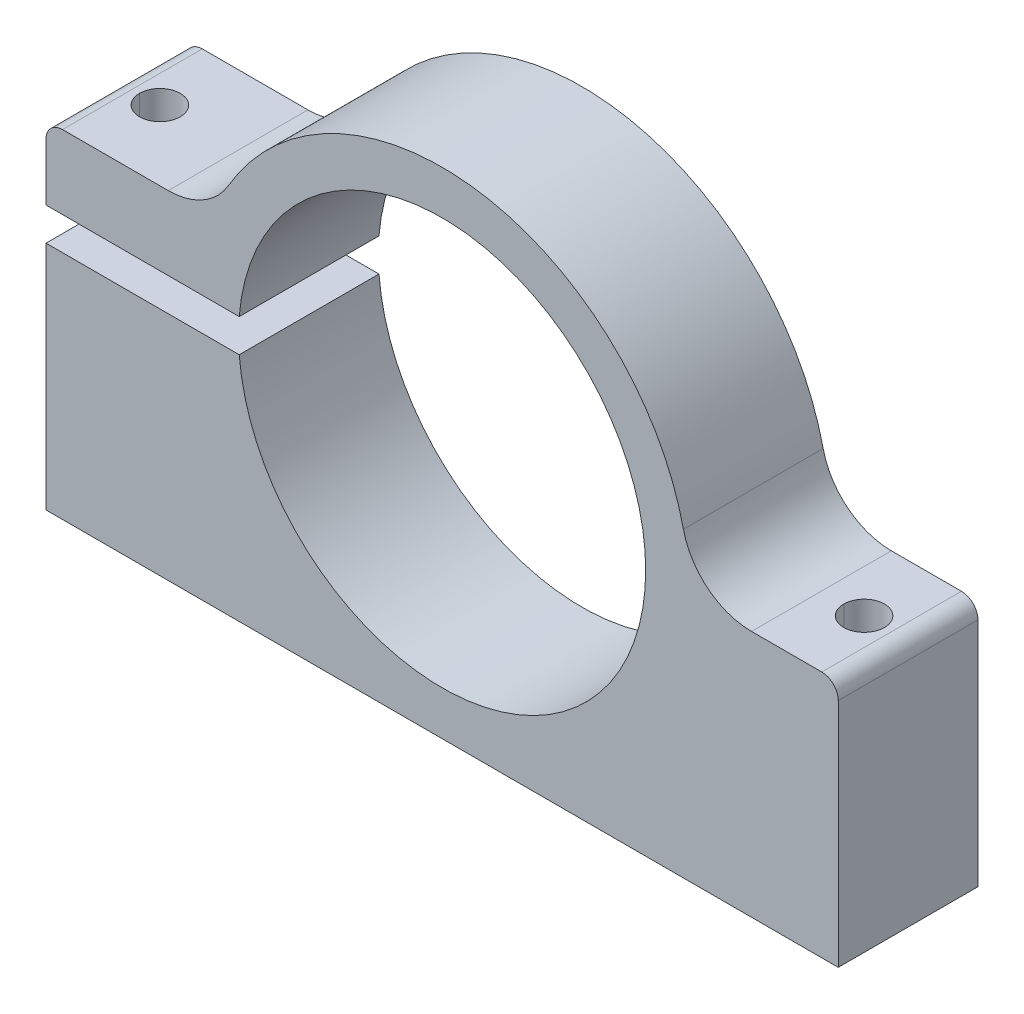
ISO-10303-21;
HEADER;
FILE_DESCRIPTION(('STEP AP214'),'2;1');
FILE_NAME('part.step','',(''),(''),'','','');
FILE_SCHEMA(('AUTOMOTIVE_DESIGN { 1 0 10303 214 1 1 1 1 }'));
ENDSEC;
DATA;
#1=APPLICATION_CONTEXT('core data for automotive mechanical design processes');
#2=APPLICATION_PROTOCOL_DEFINITION('international standard','automotive_design',2000,#1);
#3=PRODUCT_CONTEXT('',#1,'mechanical');
#4=PRODUCT('Part','Part','',(#3));
#5=PRODUCT_RELATED_PRODUCT_CATEGORY('part','',(#4));
#6=PRODUCT_DEFINITION_FORMATION('','',#4);
#7=PRODUCT_DEFINITION_CONTEXT('part definition',#1,'design');
#8=PRODUCT_DEFINITION('design','',#6,#7);
#9=PRODUCT_DEFINITION_SHAPE('','',#8);
#10=(LENGTH_UNIT() NAMED_UNIT(*) SI_UNIT(.MILLI.,.METRE.));
#11=(NAMED_UNIT(*) PLANE_ANGLE_UNIT() SI_UNIT($,.RADIAN.));
#12=(NAMED_UNIT(*) SI_UNIT($,.STERADIAN.) SOLID_ANGLE_UNIT());
#13=UNCERTAINTY_MEASURE_WITH_UNIT(LENGTH_MEASURE(1.E-05),#10,'distance_accuracy_value','');
#14=(GEOMETRIC_REPRESENTATION_CONTEXT(3) GLOBAL_UNCERTAINTY_ASSIGNED_CONTEXT((#13)) GLOBAL_UNIT_ASSIGNED_CONTEXT((#10,
#11,#12)) REPRESENTATION_CONTEXT('',''));
#15=CARTESIAN_POINT('',(0.,0.,0.));
#16=DIRECTION('',(0.,0.,1.));
#17=DIRECTION('',(1.,0.,0.));
#18=AXIS2_PLACEMENT_3D('',#15,#16,#17);
#19=CARTESIAN_POINT('',(-23.3593250544204,6.80510216704339,-12.299495872585));
#20=DIRECTION('',(0.,0.,1.));
#21=DIRECTION('',(1.,0.,0.));
#22=AXIS2_PLACEMENT_3D('',#19,#20,#21);
#23=CYLINDRICAL_SURFACE('',#22,1.5);
#24=CARTESIAN_POINT('',(-23.3593250544204,6.80510216704339,-12.299495872585));
#25=DIRECTION('',(0.,0.,-1.));
#26=DIRECTION('',(1.,0.,0.));
#27=AXIS2_PLACEMENT_3D('',#24,#25,#26);
#28=CIRCLE('',#27,1.5);
#29=CARTESIAN_POINT('',(-24.8593250544204,6.80510216704339,-12.299495872585));
#30=VERTEX_POINT('',#29);
#31=CARTESIAN_POINT('',(-23.3593250544204,8.30510216704339,-12.299495872585));
#32=VERTEX_POINT('',#31);
#33=EDGE_CURVE('E419',#30,#32,#28,.T.);
#34=ORIENTED_EDGE('',*,*,#33,.F.);
#35=DIRECTION('',(0.,0.,-1.));
#36=VECTOR('',#35,1.);
#37=CARTESIAN_POINT('',(-24.8593250544204,6.80510216704339,-12.299495872585));
#38=LINE('',#37,#36);
#39=CARTESIAN_POINT('',(-24.8593250544204,6.80510216704339,0.400504127415024));
#40=VERTEX_POINT('',#39);
#41=EDGE_CURVE('E255',#40,#30,#38,.T.);
#42=ORIENTED_EDGE('',*,*,#41,.F.);
#43=CARTESIAN_POINT('',(-23.3593250544204,6.80510216704339,0.400504127415024));
#44=DIRECTION('',(0.,0.,1.));
#45=DIRECTION('',(1.,0.,0.));
#46=AXIS2_PLACEMENT_3D('',#43,#44,#45);
#47=CIRCLE('',#46,1.5);
#48=CARTESIAN_POINT('',(-23.3593250544204,8.30510216704339,0.400504127415024));
#49=VERTEX_POINT('',#48);
#50=EDGE_CURVE('E432',#49,#40,#47,.T.);
#51=ORIENTED_EDGE('',*,*,#50,.F.);
#52=DIRECTION('',(0.,0.,1.));
#53=VECTOR('',#52,1.);
#54=CARTESIAN_POINT('',(-23.3593250544204,8.30510216704339,-12.299495872585));
#55=LINE('',#54,#53);
#56=EDGE_CURVE('E301',#32,#49,#55,.T.);
#57=ORIENTED_EDGE('',*,*,#56,.F.);
#58=EDGE_LOOP('',(#34,#42,#51,#57));
#59=FACE_BOUND('',#58,.T.);
#60=ADVANCED_FACE('F16',(#59),#23,.T.);
#61=CARTESIAN_POINT('',(45.6406749455796,-1.38591539929279,-12.299495872585));
#62=DIRECTION('',(0.,0.,1.));
#63=DIRECTION('',(1.,0.,0.));
#64=AXIS2_PLACEMENT_3D('',#61,#62,#63);
#65=CYLINDRICAL_SURFACE('',#64,1.5);
#66=CARTESIAN_POINT('',(45.6406749455796,-1.38591539929279,-12.299495872585));
#67=DIRECTION('',(0.,0.,-1.));
#68=DIRECTION('',(1.,0.,0.));
#69=AXIS2_PLACEMENT_3D('',#66,#67,#68);
#70=CIRCLE('',#69,1.5);
#71=CARTESIAN_POINT('',(45.6406749455796,0.114084600707213,-12.299495872585));
#72=VERTEX_POINT('',#71);
#73=CARTESIAN_POINT('',(47.1406749455796,-1.38591539929279,-12.299495872585));
#74=VERTEX_POINT('',#73);
#75=EDGE_CURVE('E428',#72,#74,#70,.T.);
#76=ORIENTED_EDGE('',*,*,#75,.F.);
#77=DIRECTION('',(0.,0.,-1.));
#78=VECTOR('',#77,1.);
#79=CARTESIAN_POINT('',(45.6406749455796,0.114084600707213,-12.299495872585));
#80=LINE('',#79,#78);
#81=CARTESIAN_POINT('',(45.6406749455796,0.114084600707213,0.400504127415024));
#82=VERTEX_POINT('',#81);
#83=EDGE_CURVE('E349',#82,#72,#80,.T.);
#84=ORIENTED_EDGE('',*,*,#83,.F.);
#85=CARTESIAN_POINT('',(45.6406749455796,-1.38591539929279,0.400504127415024));
#86=DIRECTION('',(0.,0.,1.));
#87=DIRECTION('',(1.,0.,0.));
#88=AXIS2_PLACEMENT_3D('',#85,#86,#87);
#89=CIRCLE('',#88,1.5);
#90=CARTESIAN_POINT('',(47.1406749455796,-1.38591539929279,0.400504127415024));
#91=VERTEX_POINT('',#90);
#92=EDGE_CURVE('E431',#91,#82,#89,.T.);
#93=ORIENTED_EDGE('',*,*,#92,.F.);
#94=DIRECTION('',(0.,0.,1.));
#95=VECTOR('',#94,1.);
#96=CARTESIAN_POINT('',(47.1406749455796,-1.38591539929279,-12.299495872585));
#97=LINE('',#96,#95);
#98=EDGE_CURVE('E382',#74,#91,#97,.T.);
#99=ORIENTED_EDGE('',*,*,#98,.F.);
#100=EDGE_LOOP('',(#76,#84,#93,#99));
#101=FACE_BOUND('',#100,.T.);
#102=ADVANCED_FACE('F494',(#101),#65,.T.);
#103=CARTESIAN_POINT('',(-13.7536558977169,14.6551021670434,-12.299495872585));
#104=DIRECTION('',(0.,0.,1.));
#105=DIRECTION('',(1.,0.,0.));
#106=AXIS2_PLACEMENT_3D('',#103,#104,#105);
#107=CYLINDRICAL_SURFACE('',#106,6.35);
#108=CARTESIAN_POINT('',(-13.7536558977169,14.6551021670434,-12.299495872585));
#109=DIRECTION('',(0.,0.,1.));
#110=DIRECTION('',(1.,0.,0.));
#111=AXIS2_PLACEMENT_3D('',#108,#109,#110);
#112=CIRCLE('',#111,6.35);
#113=CARTESIAN_POINT('',(-13.7536558977169,8.30510216704339,-12.299495872585));
#114=VERTEX_POINT('',#113);
#115=CARTESIAN_POINT('',(-8.27051330822913,11.4523459566294,-12.299495872585));
#116=VERTEX_POINT('',#115);
#117=EDGE_CURVE('E422',#114,#116,#112,.T.);
#118=ORIENTED_EDGE('',*,*,#117,.F.);
#119=DIRECTION('',(0.,0.,-1.));
#120=VECTOR('',#119,1.);
#121=CARTESIAN_POINT('',(-13.7536558977169,8.30510216704339,-12.299495872585));
#122=LINE('',#121,#120);
#123=CARTESIAN_POINT('',(-13.7536558977169,8.30510216704339,0.400504127415024));
#124=VERTEX_POINT('',#123);
#125=EDGE_CURVE('E300',#124,#114,#122,.T.);
#126=ORIENTED_EDGE('',*,*,#125,.F.);
#127=CARTESIAN_POINT('',(-13.7536558977169,14.6551021670434,0.400504127415024));
#128=DIRECTION('',(0.,0.,-1.));
#129=DIRECTION('',(1.,0.,0.));
#130=AXIS2_PLACEMENT_3D('',#127,#128,#129);
#131=CIRCLE('',#130,6.35);
#132=CARTESIAN_POINT('',(-8.27051330822913,11.4523459566294,0.400504127415024));
#133=VERTEX_POINT('',#132);
#134=EDGE_CURVE('E11',#133,#124,#131,.T.);
#135=ORIENTED_EDGE('',*,*,#134,.F.);
#136=DIRECTION('',(0.,0.,1.));
#137=VECTOR('',#136,1.);
#138=CARTESIAN_POINT('',(-8.27051330822913,11.4523459566294,-12.299495872585));
#139=LINE('',#138,#137);
#140=EDGE_CURVE('E239',#116,#133,#139,.T.);
#141=ORIENTED_EDGE('',*,*,#140,.F.);
#142=EDGE_LOOP('',(#118,#126,#135,#141));
#143=FACE_BOUND('',#142,.T.);
#144=ADVANCED_FACE('F456',(#143),#107,.F.);
#145=CARTESIAN_POINT('',(39.262666340216,6.46408460070721,-12.299495872585));
#146=DIRECTION('',(0.,0.,1.));
#147=DIRECTION('',(1.,0.,0.));
#148=AXIS2_PLACEMENT_3D('',#145,#146,#147);
#149=CYLINDRICAL_SURFACE('',#148,6.35);
#150=CARTESIAN_POINT('',(39.262666340216,6.46408460070721,-12.299495872585));
#151=DIRECTION('',(0.,0.,1.));
#152=DIRECTION('',(1.,0.,0.));
#153=AXIS2_PLACEMENT_3D('',#150,#151,#152);
#154=CIRCLE('',#153,6.35);
#155=CARTESIAN_POINT('',(33.068609962972,5.06545470129688,-12.299495872585));
#156=VERTEX_POINT('',#155);
#157=CARTESIAN_POINT('',(39.262666340216,0.114084600707213,-12.299495872585));
#158=VERTEX_POINT('',#157);
#159=EDGE_CURVE('E425',#156,#158,#154,.T.);
#160=ORIENTED_EDGE('',*,*,#159,.F.);
#161=DIRECTION('',(0.,0.,-1.));
#162=VECTOR('',#161,1.);
#163=CARTESIAN_POINT('',(33.068609962972,5.06545470129688,-12.299495872585));
#164=LINE('',#163,#162);
#165=CARTESIAN_POINT('',(33.068609962972,5.06545470129688,0.400504127415024));
#166=VERTEX_POINT('',#165);
#167=EDGE_CURVE('E350',#166,#156,#164,.T.);
#168=ORIENTED_EDGE('',*,*,#167,.F.);
#169=CARTESIAN_POINT('',(39.262666340216,6.46408460070721,0.400504127415024));
#170=DIRECTION('',(0.,0.,-1.));
#171=DIRECTION('',(1.,0.,0.));
#172=AXIS2_PLACEMENT_3D('',#169,#170,#171);
#173=CIRCLE('',#172,6.35);
#174=CARTESIAN_POINT('',(39.262666340216,0.114084600707213,0.400504127415024));
#175=VERTEX_POINT('',#174);
#176=EDGE_CURVE('E24',#175,#166,#173,.T.);
#177=ORIENTED_EDGE('',*,*,#176,.F.);
#178=DIRECTION('',(0.,0.,1.));
#179=VECTOR('',#178,1.);
#180=CARTESIAN_POINT('',(39.262666340216,0.114084600707213,0.400504127415024));
#181=LINE('',#180,#179);
#182=EDGE_CURVE('E372',#158,#175,#181,.T.);
#183=ORIENTED_EDGE('',*,*,#182,.F.);
#184=EDGE_LOOP('',(#160,#168,#177,#183));
#185=FACE_BOUND('',#184,.T.);
#186=ADVANCED_FACE('F450',(#185),#149,.F.);
#187=CARTESIAN_POINT('',(43.1406749455796,-22.3859153992928,-5.94949587258498));
#188=DIRECTION('',(0.,1.,0.));
#189=DIRECTION('',(-1.,0.,0.));
#190=AXIS2_PLACEMENT_3D('',#187,#188,#189);
#191=CYLINDRICAL_SURFACE('',#190,1.85);
#192=DIRECTION('',(0.,1.,0.));
#193=VECTOR('',#192,1.);
#194=CARTESIAN_POINT('',(44.9906749455796,-22.3859153992928,-5.94949587258498));
#195=LINE('',#194,#193);
#196=CARTESIAN_POINT('',(44.9906749455796,-22.3859153992928,-5.94949587258498));
#197=VERTEX_POINT('',#196);
#198=CARTESIAN_POINT('',(44.9906749455796,0.114084600707213,-5.94949587258498));
#199=VERTEX_POINT('',#198);
#200=EDGE_CURVE('E222',#197,#199,#195,.T.);
#201=ORIENTED_EDGE('',*,*,#200,.F.);
#202=CARTESIAN_POINT('',(43.1406749455796,-22.3859153992928,-5.94949587258498));
#203=DIRECTION('',(0.,1.,0.));
#204=DIRECTION('',(-1.,0.,0.));
#205=AXIS2_PLACEMENT_3D('',#202,#203,#204);
#206=CIRCLE('',#205,1.85);
#207=CARTESIAN_POINT('',(41.2906749455796,-22.3859153992928,-5.94949587258498));
#208=VERTEX_POINT('',#207);
#209=EDGE_CURVE('E208',#208,#197,#206,.T.);
#210=ORIENTED_EDGE('',*,*,#209,.F.);
#211=DIRECTION('',(0.,1.,0.));
#212=VECTOR('',#211,1.);
#213=CARTESIAN_POINT('',(41.2906749455796,-22.3859153992928,-5.94949587258498));
#214=LINE('',#213,#212);
#215=CARTESIAN_POINT('',(41.2906749455796,0.114084600707213,-5.94949587258498));
#216=VERTEX_POINT('',#215);
#217=EDGE_CURVE('E232',#208,#216,#214,.T.);
#218=ORIENTED_EDGE('',*,*,#217,.T.);
#219=CARTESIAN_POINT('',(43.1406749455796,0.114084600707213,-5.94949587258498));
#220=DIRECTION('',(0.,1.,0.));
#221=DIRECTION('',(-1.,0.,0.));
#222=AXIS2_PLACEMENT_3D('',#219,#220,#221);
#223=CIRCLE('',#222,1.85);
#224=EDGE_CURVE('E224',#216,#199,#223,.T.);
#225=ORIENTED_EDGE('',*,*,#224,.T.);
#226=EDGE_LOOP('',(#201,#210,#218,#225));
#227=FACE_BOUND('',#226,.T.);
#228=ADVANCED_FACE('F223',(#227),#191,.F.);
#229=CARTESIAN_POINT('',(-20.8593250544204,-22.3859153992928,-5.94949587258498));
#230=DIRECTION('',(0.,1.,0.));
#231=DIRECTION('',(-1.,0.,0.));
#232=AXIS2_PLACEMENT_3D('',#229,#230,#231);
#233=CYLINDRICAL_SURFACE('',#232,1.85);
#234=DIRECTION('',(0.,1.,0.));
#235=VECTOR('',#234,1.);
#236=CARTESIAN_POINT('',(-19.0093250544205,-22.3859153992928,-5.94949587258498));
#237=LINE('',#236,#235);
#238=CARTESIAN_POINT('',(-19.0093250544205,1.61408460070721,-5.94949587258498));
#239=VERTEX_POINT('',#238);
#240=CARTESIAN_POINT('',(-19.0093250544204,8.30510216704339,-5.94949587258498));
#241=VERTEX_POINT('',#240);
#242=EDGE_CURVE('E244',#239,#241,#237,.T.);
#243=ORIENTED_EDGE('',*,*,#242,.F.);
#244=CARTESIAN_POINT('',(-20.8593250544204,1.61408460070721,-5.94949587258498));
#245=DIRECTION('',(0.,1.,0.));
#246=DIRECTION('',(-1.,0.,0.));
#247=AXIS2_PLACEMENT_3D('',#244,#245,#246);
#248=CIRCLE('',#247,1.85);
#249=CARTESIAN_POINT('',(-22.7093250544205,1.61408460070721,-5.94949587258498));
#250=VERTEX_POINT('',#249);
#251=EDGE_CURVE('E328',#250,#239,#248,.T.);
#252=ORIENTED_EDGE('',*,*,#251,.F.);
#253=DIRECTION('',(0.,1.,0.));
#254=VECTOR('',#253,1.);
#255=CARTESIAN_POINT('',(-22.7093250544205,-22.3859153992928,-5.94949587258498));
#256=LINE('',#255,#254);
#257=CARTESIAN_POINT('',(-22.7093250544205,8.30510216704339,-5.94949587258498));
#258=VERTEX_POINT('',#257);
#259=EDGE_CURVE('E261',#250,#258,#256,.T.);
#260=ORIENTED_EDGE('',*,*,#259,.T.);
#261=CARTESIAN_POINT('',(-20.8593250544204,8.30510216704339,-5.94949587258498));
#262=DIRECTION('',(0.,1.,0.));
#263=DIRECTION('',(-1.,0.,0.));
#264=AXIS2_PLACEMENT_3D('',#261,#262,#263);
#265=CIRCLE('',#264,1.85);
#266=EDGE_CURVE('E344',#258,#241,#265,.T.);
#267=ORIENTED_EDGE('',*,*,#266,.T.);
#268=EDGE_LOOP('',(#243,#252,#260,#267));
#269=FACE_BOUND('',#268,.T.);
#270=ADVANCED_FACE('F525',(#269),#233,.F.);
#271=CARTESIAN_POINT('',(-20.8593250544204,-22.3859153992928,-5.94949587258498));
#272=DIRECTION('',(0.,1.,0.));
#273=DIRECTION('',(-1.,0.,0.));
#274=AXIS2_PLACEMENT_3D('',#271,#272,#273);
#275=CYLINDRICAL_SURFACE('',#274,1.85);
#276=DIRECTION('',(0.,1.,0.));
#277=VECTOR('',#276,1.);
#278=CARTESIAN_POINT('',(-19.0093250544205,-22.3859153992928,-5.94949587258498));
#279=LINE('',#278,#277);
#280=CARTESIAN_POINT('',(-19.0093250544205,-22.3859153992928,-5.94949587258498));
#281=VERTEX_POINT('',#280);
#282=CARTESIAN_POINT('',(-19.0093250544205,-1.38591539929279,-5.94949587258498));
#283=VERTEX_POINT('',#282);
#284=EDGE_CURVE('E285',#281,#283,#279,.T.);
#285=ORIENTED_EDGE('',*,*,#284,.F.);
#286=CARTESIAN_POINT('',(-20.8593250544204,-22.3859153992928,-5.94949587258498));
#287=DIRECTION('',(0.,1.,0.));
#288=DIRECTION('',(-1.,0.,0.));
#289=AXIS2_PLACEMENT_3D('',#286,#287,#288);
#290=CIRCLE('',#289,1.85);
#291=CARTESIAN_POINT('',(-22.7093250544205,-22.3859153992928,-5.94949587258498));
#292=VERTEX_POINT('',#291);
#293=EDGE_CURVE('E218',#292,#281,#290,.T.);
#294=ORIENTED_EDGE('',*,*,#293,.F.);
#295=DIRECTION('',(0.,1.,0.));
#296=VECTOR('',#295,1.);
#297=CARTESIAN_POINT('',(-22.7093250544205,-22.3859153992928,-5.94949587258498));
#298=LINE('',#297,#296);
#299=CARTESIAN_POINT('',(-22.7093250544205,-1.38591539929279,-5.94949587258498));
#300=VERTEX_POINT('',#299);
#301=EDGE_CURVE('E286',#292,#300,#298,.T.);
#302=ORIENTED_EDGE('',*,*,#301,.T.);
#303=CARTESIAN_POINT('',(-20.8593250544204,-1.38591539929279,-5.94949587258498));
#304=DIRECTION('',(0.,1.,0.));
#305=DIRECTION('',(-1.,0.,0.));
#306=AXIS2_PLACEMENT_3D('',#303,#304,#305);
#307=CIRCLE('',#306,1.85);
#308=EDGE_CURVE('E416',#300,#283,#307,.T.);
#309=ORIENTED_EDGE('',*,*,#308,.T.);
#310=EDGE_LOOP('',(#285,#294,#302,#309));
#311=FACE_BOUND('',#310,.T.);
#312=ADVANCED_FACE('F526',(#311),#275,.F.);
#313=CARTESIAN_POINT('',(11.1406749455796,0.114084600707214,-12.299495872585));
#314=DIRECTION('',(0.,0.,1.));
#315=DIRECTION('',(1.,0.,0.));
#316=AXIS2_PLACEMENT_3D('',#313,#314,#315);
#317=CYLINDRICAL_SURFACE('',#316,18.5);
#318=DIRECTION('',(0.,0.,1.));
#319=VECTOR('',#318,1.);
#320=CARTESIAN_POINT('',(29.6406749455796,0.114084600707214,-12.299495872585));
#321=LINE('',#320,#319);
#322=CARTESIAN_POINT('',(29.6406749455796,0.114084600707214,-12.299495872585));
#323=VERTEX_POINT('',#322);
#324=CARTESIAN_POINT('',(29.6406749455796,0.114084600707214,0.400504127415024));
#325=VERTEX_POINT('',#324);
#326=EDGE_CURVE('E295',#323,#325,#321,.T.);
#327=ORIENTED_EDGE('',*,*,#326,.F.);
#328=CARTESIAN_POINT('',(11.1406749455796,0.114084600707214,-12.299495872585));
#329=DIRECTION('',(0.,0.,1.));
#330=DIRECTION('',(1.,0.,0.));
#331=AXIS2_PLACEMENT_3D('',#328,#329,#330);
#332=CIRCLE('',#331,18.5);
#333=CARTESIAN_POINT('',(-7.29841396900619,-1.38591539929279,-12.299495872585));
#334=VERTEX_POINT('',#333);
#335=EDGE_CURVE('E37',#334,#323,#332,.T.);
#336=ORIENTED_EDGE('',*,*,#335,.F.);
#337=DIRECTION('',(0.,0.,1.));
#338=VECTOR('',#337,1.);
#339=CARTESIAN_POINT('',(-7.29841396900619,-1.38591539929279,-12.299495872585));
#340=LINE('',#339,#338);
#341=CARTESIAN_POINT('',(-7.29841396900619,-1.38591539929284,0.400504127415024));
#342=VERTEX_POINT('',#341);
#343=EDGE_CURVE('E368',#334,#342,#340,.T.);
#344=ORIENTED_EDGE('',*,*,#343,.T.);
#345=CARTESIAN_POINT('',(11.1406749455796,0.114084600707214,0.400504127415024));
#346=DIRECTION('',(0.,0.,1.));
#347=DIRECTION('',(1.,0.,0.));
#348=AXIS2_PLACEMENT_3D('',#345,#346,#347);
#349=CIRCLE('',#348,18.5);
#350=EDGE_CURVE('E48',#342,#325,#349,.T.);
#351=ORIENTED_EDGE('',*,*,#350,.T.);
#352=EDGE_LOOP('',(#327,#336,#344,#351));
#353=FACE_BOUND('',#352,.T.);
#354=ADVANCED_FACE('F473',(#353),#317,.F.);
#355=CARTESIAN_POINT('',(11.1406749455796,0.114084600707214,0.400504127415024));
#356=DIRECTION('',(0.,0.,1.));
#357=DIRECTION('',(1.,0.,0.));
#358=AXIS2_PLACEMENT_3D('',#355,#356,#357);
#359=PLANE('',#358);
#360=DIRECTION('',(1.,0.,0.));
#361=VECTOR('',#360,1.);
#362=CARTESIAN_POINT('',(-24.8593250544204,8.30510216704339,0.400504127415024));
#363=LINE('',#362,#361);
#364=EDGE_CURVE('E296',#49,#124,#363,.T.);
#365=ORIENTED_EDGE('',*,*,#364,.F.);
#366=ORIENTED_EDGE('',*,*,#50,.T.);
#367=DIRECTION('',(0.,1.,0.));
#368=VECTOR('',#367,1.);
#369=CARTESIAN_POINT('',(-24.8593250544204,1.61408460070721,0.400504127415024));
#370=LINE('',#369,#368);
#371=CARTESIAN_POINT('',(-24.8593250544204,1.61408460070721,0.400504127415024));
#372=VERTEX_POINT('',#371);
#373=EDGE_CURVE('E331',#372,#40,#370,.T.);
#374=ORIENTED_EDGE('',*,*,#373,.F.);
#375=DIRECTION('',(-1.,0.,0.));
#376=VECTOR('',#375,1.);
#377=CARTESIAN_POINT('',(-11.2892247421141,1.61408460070721,0.400504127415024));
#378=LINE('',#377,#376);
#379=CARTESIAN_POINT('',(-7.2984139690062,1.61408460070721,0.400504127415024));
#380=VERTEX_POINT('',#379);
#381=EDGE_CURVE('E276',#380,#372,#378,.T.);
#382=ORIENTED_EDGE('',*,*,#381,.F.);
#383=CARTESIAN_POINT('',(11.1406749455796,0.114084600707214,0.400504127415024));
#384=DIRECTION('',(0.,0.,1.));
#385=DIRECTION('',(1.,0.,0.));
#386=AXIS2_PLACEMENT_3D('',#383,#384,#385);
#387=CIRCLE('',#386,18.5);
#388=EDGE_CURVE('E277',#325,#380,#387,.T.);
#389=ORIENTED_EDGE('',*,*,#388,.F.);
#390=ORIENTED_EDGE('',*,*,#350,.F.);
#391=DIRECTION('',(-1.,0.,0.));
#392=VECTOR('',#391,1.);
#393=CARTESIAN_POINT('',(-11.2892247421141,-1.38591539929279,0.400504127415024));
#394=LINE('',#393,#392);
#395=CARTESIAN_POINT('',(-24.8593250544204,-1.38591539929279,0.400504127415024));
#396=VERTEX_POINT('',#395);
#397=EDGE_CURVE('E270',#342,#396,#394,.T.);
#398=ORIENTED_EDGE('',*,*,#397,.T.);
#399=DIRECTION('',(0.,-1.,0.));
#400=VECTOR('',#399,1.);
#401=CARTESIAN_POINT('',(-24.8593250544204,-1.38591539929279,0.400504127415024));
#402=LINE('',#401,#400);
#403=CARTESIAN_POINT('',(-24.8593250544204,-22.3859153992928,0.400504127415024));
#404=VERTEX_POINT('',#403);
#405=EDGE_CURVE('E405',#396,#404,#402,.T.);
#406=ORIENTED_EDGE('',*,*,#405,.T.);
#407=DIRECTION('',(1.,0.,0.));
#408=VECTOR('',#407,1.);
#409=CARTESIAN_POINT('',(-24.8593250544204,-22.3859153992928,0.400504127415024));
#410=LINE('',#409,#408);
#411=CARTESIAN_POINT('',(47.1406749455796,-22.3859153992928,0.400504127415024));
#412=VERTEX_POINT('',#411);
#413=EDGE_CURVE('E394',#404,#412,#410,.T.);
#414=ORIENTED_EDGE('',*,*,#413,.T.);
#415=DIRECTION('',(0.,1.,0.));
#416=VECTOR('',#415,1.);
#417=CARTESIAN_POINT('',(47.1406749455796,-22.3859153992928,0.400504127415024));
#418=LINE('',#417,#416);
#419=EDGE_CURVE('E386',#412,#91,#418,.T.);
#420=ORIENTED_EDGE('',*,*,#419,.T.);
#421=ORIENTED_EDGE('',*,*,#92,.T.);
#422=DIRECTION('',(-1.,0.,0.));
#423=VECTOR('',#422,1.);
#424=CARTESIAN_POINT('',(47.1406749455796,0.114084600707213,0.400504127415024));
#425=LINE('',#424,#423);
#426=EDGE_CURVE('E345',#82,#175,#425,.T.);
#427=ORIENTED_EDGE('',*,*,#426,.T.);
#428=ORIENTED_EDGE('',*,*,#176,.T.);
#429=CARTESIAN_POINT('',(11.1406749455796,0.114084600707214,0.400504127415024));
#430=DIRECTION('',(0.,0.,1.));
#431=DIRECTION('',(1.,0.,0.));
#432=AXIS2_PLACEMENT_3D('',#429,#430,#431);
#433=CIRCLE('',#432,22.48);
#434=EDGE_CURVE('E242',#166,#133,#433,.T.);
#435=ORIENTED_EDGE('',*,*,#434,.T.);
#436=ORIENTED_EDGE('',*,*,#134,.T.);
#437=EDGE_LOOP('',(#365,#366,#374,#382,#389,#390,#398,#406,#414,#420,#421,#427,#428,#435,#436));
#438=FACE_BOUND('',#437,.T.);
#439=ADVANCED_FACE('F445',(#438),#359,.T.);
#440=CARTESIAN_POINT('',(11.1406749455796,0.114084600707214,-12.299495872585));
#441=DIRECTION('',(0.,0.,1.));
#442=DIRECTION('',(1.,0.,0.));
#443=AXIS2_PLACEMENT_3D('',#440,#441,#442);
#444=PLANE('',#443);
#445=DIRECTION('',(0.,1.,0.));
#446=VECTOR('',#445,1.);
#447=CARTESIAN_POINT('',(-24.8593250544204,1.61408460070721,-12.299495872585));
#448=LINE('',#447,#446);
#449=CARTESIAN_POINT('',(-24.8593250544204,1.61408460070721,-12.299495872585));
#450=VERTEX_POINT('',#449);
#451=EDGE_CURVE('E250',#450,#30,#448,.T.);
#452=ORIENTED_EDGE('',*,*,#451,.T.);
#453=ORIENTED_EDGE('',*,*,#33,.T.);
#454=DIRECTION('',(1.,0.,0.));
#455=VECTOR('',#454,1.);
#456=CARTESIAN_POINT('',(-24.8593250544204,8.30510216704339,-12.299495872585));
#457=LINE('',#456,#455);
#458=EDGE_CURVE('E254',#32,#114,#457,.T.);
#459=ORIENTED_EDGE('',*,*,#458,.T.);
#460=ORIENTED_EDGE('',*,*,#117,.T.);
#461=CARTESIAN_POINT('',(11.1406749455796,0.114084600707214,-12.299495872585));
#462=DIRECTION('',(0.,0.,1.));
#463=DIRECTION('',(1.,0.,0.));
#464=AXIS2_PLACEMENT_3D('',#461,#462,#463);
#465=CIRCLE('',#464,22.48);
#466=EDGE_CURVE('E243',#156,#116,#465,.T.);
#467=ORIENTED_EDGE('',*,*,#466,.F.);
#468=ORIENTED_EDGE('',*,*,#159,.T.);
#469=DIRECTION('',(-1.,0.,0.));
#470=VECTOR('',#469,1.);
#471=CARTESIAN_POINT('',(47.1406749455796,0.114084600707213,-12.299495872585));
#472=LINE('',#471,#470);
#473=EDGE_CURVE('E365',#72,#158,#472,.T.);
#474=ORIENTED_EDGE('',*,*,#473,.F.);
#475=ORIENTED_EDGE('',*,*,#75,.T.);
#476=DIRECTION('',(0.,1.,0.));
#477=VECTOR('',#476,1.);
#478=CARTESIAN_POINT('',(47.1406749455796,-22.3859153992928,-12.299495872585));
#479=LINE('',#478,#477);
#480=CARTESIAN_POINT('',(47.1406749455796,-22.3859153992928,-12.299495872585));
#481=VERTEX_POINT('',#480);
#482=EDGE_CURVE('E378',#481,#74,#479,.T.);
#483=ORIENTED_EDGE('',*,*,#482,.F.);
#484=DIRECTION('',(1.,0.,0.));
#485=VECTOR('',#484,1.);
#486=CARTESIAN_POINT('',(-24.8593250544204,-22.3859153992928,-12.299495872585));
#487=LINE('',#486,#485);
#488=CARTESIAN_POINT('',(-24.8593250544204,-22.3859153992928,-12.299495872585));
#489=VERTEX_POINT('',#488);
#490=EDGE_CURVE('E219',#489,#481,#487,.T.);
#491=ORIENTED_EDGE('',*,*,#490,.F.);
#492=DIRECTION('',(0.,-1.,0.));
#493=VECTOR('',#492,1.);
#494=CARTESIAN_POINT('',(-24.8593250544204,-1.38591539929279,-12.299495872585));
#495=LINE('',#494,#493);
#496=CARTESIAN_POINT('',(-24.8593250544204,-1.38591539929279,-12.299495872585));
#497=VERTEX_POINT('',#496);
#498=EDGE_CURVE('E267',#497,#489,#495,.T.);
#499=ORIENTED_EDGE('',*,*,#498,.F.);
#500=DIRECTION('',(-1.,0.,0.));
#501=VECTOR('',#500,1.);
#502=CARTESIAN_POINT('',(-11.2892247421141,-1.38591539929279,-12.299495872585));
#503=LINE('',#502,#501);
#504=EDGE_CURVE('E413',#334,#497,#503,.T.);
#505=ORIENTED_EDGE('',*,*,#504,.F.);
#506=ORIENTED_EDGE('',*,*,#335,.T.);
#507=CARTESIAN_POINT('',(11.1406749455796,0.114084600707214,-12.299495872585));
#508=DIRECTION('',(0.,0.,1.));
#509=DIRECTION('',(1.,0.,0.));
#510=AXIS2_PLACEMENT_3D('',#507,#508,#509);
#511=CIRCLE('',#510,18.5);
#512=CARTESIAN_POINT('',(-7.2984139690062,1.61408460070722,-12.299495872585));
#513=VERTEX_POINT('',#512);
#514=EDGE_CURVE('E290',#323,#513,#511,.T.);
#515=ORIENTED_EDGE('',*,*,#514,.T.);
#516=DIRECTION('',(-1.,0.,0.));
#517=VECTOR('',#516,1.);
#518=CARTESIAN_POINT('',(-11.2892247421141,1.61408460070721,-12.299495872585));
#519=LINE('',#518,#517);
#520=EDGE_CURVE('E324',#513,#450,#519,.T.);
#521=ORIENTED_EDGE('',*,*,#520,.T.);
#522=EDGE_LOOP('',(#452,#453,#459,#460,#467,#468,#474,#475,#483,#491,#499,#505,#506,#515,#521));
#523=FACE_BOUND('',#522,.T.);
#524=ADVANCED_FACE('F499',(#523),#444,.F.);
#525=CARTESIAN_POINT('',(-11.2892247421141,-1.38591539929279,-12.299495872585));
#526=DIRECTION('',(0.,1.,0.));
#527=DIRECTION('',(1.,0.,0.));
#528=AXIS2_PLACEMENT_3D('',#525,#526,#527);
#529=PLANE('',#528);
#530=ORIENTED_EDGE('',*,*,#308,.F.);
#531=CARTESIAN_POINT('',(-20.8593250544204,-1.38591539929279,-5.94949587258498));
#532=DIRECTION('',(0.,1.,0.));
#533=DIRECTION('',(-1.,0.,0.));
#534=AXIS2_PLACEMENT_3D('',#531,#532,#533);
#535=CIRCLE('',#534,1.85);
#536=EDGE_CURVE('E291',#283,#300,#535,.T.);
#537=ORIENTED_EDGE('',*,*,#536,.F.);
#538=EDGE_LOOP('',(#530,#537));
#539=FACE_BOUND('',#538,.T.);
#540=ORIENTED_EDGE('',*,*,#397,.F.);
#541=ORIENTED_EDGE('',*,*,#343,.F.);
#542=ORIENTED_EDGE('',*,*,#504,.T.);
#543=DIRECTION('',(0.,0.,1.));
#544=VECTOR('',#543,1.);
#545=CARTESIAN_POINT('',(-24.8593250544204,-1.38591539929279,-12.299495872585));
#546=LINE('',#545,#544);
#547=EDGE_CURVE('E271',#497,#396,#546,.T.);
#548=ORIENTED_EDGE('',*,*,#547,.T.);
#549=EDGE_LOOP('',(#540,#541,#542,#548));
#550=FACE_BOUND('',#549,.T.);
#551=ADVANCED_FACE('F477',(#539,#550),#529,.T.);
#552=CARTESIAN_POINT('',(-24.8593250544204,-1.38591539929279,-12.299495872585));
#553=DIRECTION('',(-1.,0.,0.));
#554=DIRECTION('',(0.,1.,0.));
#555=AXIS2_PLACEMENT_3D('',#552,#553,#554);
#556=PLANE('',#555);
#557=ORIENTED_EDGE('',*,*,#405,.F.);
#558=ORIENTED_EDGE('',*,*,#547,.F.);
#559=ORIENTED_EDGE('',*,*,#498,.T.);
#560=DIRECTION('',(0.,0.,1.));
#561=VECTOR('',#560,1.);
#562=CARTESIAN_POINT('',(-24.8593250544204,-22.3859153992928,-12.299495872585));
#563=LINE('',#562,#561);
#564=EDGE_CURVE('E397',#489,#404,#563,.T.);
#565=ORIENTED_EDGE('',*,*,#564,.T.);
#566=EDGE_LOOP('',(#557,#558,#559,#565));
#567=FACE_BOUND('',#566,.T.);
#568=ADVANCED_FACE('F483',(#567),#556,.T.);
#569=CARTESIAN_POINT('',(-24.8593250544204,-22.3859153992928,-12.299495872585));
#570=DIRECTION('',(0.,-1.,0.));
#571=DIRECTION('',(0.,0.,-1.));
#572=AXIS2_PLACEMENT_3D('',#569,#570,#571);
#573=PLANE('',#572);
#574=ORIENTED_EDGE('',*,*,#293,.T.);
#575=CARTESIAN_POINT('',(-20.8593250544204,-22.3859153992928,-5.94949587258498));
#576=DIRECTION('',(0.,1.,0.));
#577=DIRECTION('',(-1.,0.,0.));
#578=AXIS2_PLACEMENT_3D('',#575,#576,#577);
#579=CIRCLE('',#578,1.85);
#580=EDGE_CURVE('E281',#281,#292,#579,.T.);
#581=ORIENTED_EDGE('',*,*,#580,.T.);
#582=EDGE_LOOP('',(#574,#581));
#583=FACE_BOUND('',#582,.T.);
#584=ORIENTED_EDGE('',*,*,#209,.T.);
#585=CARTESIAN_POINT('',(43.1406749455796,-22.3859153992928,-5.94949587258498));
#586=DIRECTION('',(0.,1.,0.));
#587=DIRECTION('',(-1.,0.,0.));
#588=AXIS2_PLACEMENT_3D('',#585,#586,#587);
#589=CIRCLE('',#588,1.85);
#590=EDGE_CURVE('E213',#197,#208,#589,.T.);
#591=ORIENTED_EDGE('',*,*,#590,.T.);
#592=EDGE_LOOP('',(#584,#591));
#593=FACE_BOUND('',#592,.T.);
#594=ORIENTED_EDGE('',*,*,#413,.F.);
#595=ORIENTED_EDGE('',*,*,#564,.F.);
#596=ORIENTED_EDGE('',*,*,#490,.T.);
#597=DIRECTION('',(0.,0.,1.));
#598=VECTOR('',#597,1.);
#599=CARTESIAN_POINT('',(47.1406749455796,-22.3859153992928,-12.299495872585));
#600=LINE('',#599,#598);
#601=EDGE_CURVE('E390',#481,#412,#600,.T.);
#602=ORIENTED_EDGE('',*,*,#601,.T.);
#603=EDGE_LOOP('',(#594,#595,#596,#602));
#604=FACE_BOUND('',#603,.T.);
#605=ADVANCED_FACE('F210',(#583,#593,#604),#573,.T.);
#606=CARTESIAN_POINT('',(47.1406749455796,-22.3859153992928,-12.299495872585));
#607=DIRECTION('',(1.,0.,0.));
#608=DIRECTION('',(0.,-1.,0.));
#609=AXIS2_PLACEMENT_3D('',#606,#607,#608);
#610=PLANE('',#609);
#611=ORIENTED_EDGE('',*,*,#482,.T.);
#612=ORIENTED_EDGE('',*,*,#98,.T.);
#613=ORIENTED_EDGE('',*,*,#419,.F.);
#614=ORIENTED_EDGE('',*,*,#601,.F.);
#615=EDGE_LOOP('',(#611,#612,#613,#614));
#616=FACE_BOUND('',#615,.T.);
#617=ADVANCED_FACE('F490',(#616),#610,.T.);
#618=CARTESIAN_POINT('',(47.1406749455796,0.114084600707213,-12.299495872585));
#619=DIRECTION('',(0.,1.,0.));
#620=DIRECTION('',(1.,0.,0.));
#621=AXIS2_PLACEMENT_3D('',#618,#619,#620);
#622=PLANE('',#621);
#623=ORIENTED_EDGE('',*,*,#224,.F.);
#624=CARTESIAN_POINT('',(43.1406749455796,0.114084600707213,-5.94949587258498));
#625=DIRECTION('',(0.,1.,0.));
#626=DIRECTION('',(-1.,0.,0.));
#627=AXIS2_PLACEMENT_3D('',#624,#625,#626);
#628=CIRCLE('',#627,1.85);
#629=EDGE_CURVE('E229',#199,#216,#628,.T.);
#630=ORIENTED_EDGE('',*,*,#629,.F.);
#631=EDGE_LOOP('',(#623,#630));
#632=FACE_BOUND('',#631,.T.);
#633=ORIENTED_EDGE('',*,*,#426,.F.);
#634=ORIENTED_EDGE('',*,*,#83,.T.);
#635=ORIENTED_EDGE('',*,*,#473,.T.);
#636=ORIENTED_EDGE('',*,*,#182,.T.);
#637=EDGE_LOOP('',(#633,#634,#635,#636));
#638=FACE_BOUND('',#637,.T.);
#639=ADVANCED_FACE('F497',(#632,#638),#622,.T.);
#640=CARTESIAN_POINT('',(11.1406749455796,0.114084600707214,-12.299495872585));
#641=DIRECTION('',(0.,0.,1.));
#642=DIRECTION('',(1.,0.,0.));
#643=AXIS2_PLACEMENT_3D('',#640,#641,#642);
#644=CYLINDRICAL_SURFACE('',#643,22.48);
#645=ORIENTED_EDGE('',*,*,#466,.T.);
#646=ORIENTED_EDGE('',*,*,#140,.T.);
#647=ORIENTED_EDGE('',*,*,#434,.F.);
#648=ORIENTED_EDGE('',*,*,#167,.T.);
#649=EDGE_LOOP('',(#645,#646,#647,#648));
#650=FACE_BOUND('',#649,.T.);
#651=ADVANCED_FACE('F453',(#650),#644,.T.);
#652=CARTESIAN_POINT('',(-24.8593250544204,8.30510216704339,-12.299495872585));
#653=DIRECTION('',(0.,-1.,0.));
#654=DIRECTION('',(-1.,0.,0.));
#655=AXIS2_PLACEMENT_3D('',#652,#653,#654);
#656=PLANE('',#655);
#657=ORIENTED_EDGE('',*,*,#266,.F.);
#658=CARTESIAN_POINT('',(-20.8593250544204,8.30510216704339,-5.94949587258498));
#659=DIRECTION('',(0.,1.,0.));
#660=DIRECTION('',(-1.,0.,0.));
#661=AXIS2_PLACEMENT_3D('',#658,#659,#660);
#662=CIRCLE('',#661,1.85);
#663=EDGE_CURVE('E247',#241,#258,#662,.T.);
#664=ORIENTED_EDGE('',*,*,#663,.F.);
#665=EDGE_LOOP('',(#657,#664));
#666=FACE_BOUND('',#665,.T.);
#667=ORIENTED_EDGE('',*,*,#458,.F.);
#668=ORIENTED_EDGE('',*,*,#56,.T.);
#669=ORIENTED_EDGE('',*,*,#364,.T.);
#670=ORIENTED_EDGE('',*,*,#125,.T.);
#671=EDGE_LOOP('',(#667,#668,#669,#670));
#672=FACE_BOUND('',#671,.T.);
#673=ADVANCED_FACE('F462',(#666,#672),#656,.F.);
#674=CARTESIAN_POINT('',(-24.8593250544204,1.61408460070721,-12.299495872585));
#675=DIRECTION('',(1.,0.,0.));
#676=DIRECTION('',(0.,1.,0.));
#677=AXIS2_PLACEMENT_3D('',#674,#675,#676);
#678=PLANE('',#677);
#679=ORIENTED_EDGE('',*,*,#373,.T.);
#680=ORIENTED_EDGE('',*,*,#41,.T.);
#681=ORIENTED_EDGE('',*,*,#451,.F.);
#682=DIRECTION('',(0.,0.,1.));
#683=VECTOR('',#682,1.);
#684=CARTESIAN_POINT('',(-24.8593250544204,1.61408460070721,-12.299495872585));
#685=LINE('',#684,#683);
#686=EDGE_CURVE('E320',#450,#372,#685,.T.);
#687=ORIENTED_EDGE('',*,*,#686,.T.);
#688=EDGE_LOOP('',(#679,#680,#681,#687));
#689=FACE_BOUND('',#688,.T.);
#690=ADVANCED_FACE('F465',(#689),#678,.F.);
#691=CARTESIAN_POINT('',(-11.2892247421141,1.61408460070721,-12.299495872585));
#692=DIRECTION('',(0.,1.,0.));
#693=DIRECTION('',(1.,0.,0.));
#694=AXIS2_PLACEMENT_3D('',#691,#692,#693);
#695=PLANE('',#694);
#696=ORIENTED_EDGE('',*,*,#251,.T.);
#697=CARTESIAN_POINT('',(-20.8593250544204,1.61408460070721,-5.94949587258498));
#698=DIRECTION('',(0.,1.,0.));
#699=DIRECTION('',(-1.,0.,0.));
#700=AXIS2_PLACEMENT_3D('',#697,#698,#699);
#701=CIRCLE('',#700,1.85);
#702=EDGE_CURVE('E248',#239,#250,#701,.T.);
#703=ORIENTED_EDGE('',*,*,#702,.T.);
#704=EDGE_LOOP('',(#696,#703));
#705=FACE_BOUND('',#704,.T.);
#706=ORIENTED_EDGE('',*,*,#381,.T.);
#707=ORIENTED_EDGE('',*,*,#686,.F.);
#708=ORIENTED_EDGE('',*,*,#520,.F.);
#709=DIRECTION('',(0.,0.,1.));
#710=VECTOR('',#709,1.);
#711=CARTESIAN_POINT('',(-7.2984139690062,1.61408460070721,-12.299495872585));
#712=LINE('',#711,#710);
#713=EDGE_CURVE('E272',#513,#380,#712,.T.);
#714=ORIENTED_EDGE('',*,*,#713,.T.);
#715=EDGE_LOOP('',(#706,#707,#708,#714));
#716=FACE_BOUND('',#715,.T.);
#717=ADVANCED_FACE('F469',(#705,#716),#695,.F.);
#718=CARTESIAN_POINT('',(11.1406749455796,0.114084600707214,-12.299495872585));
#719=DIRECTION('',(0.,0.,1.));
#720=DIRECTION('',(1.,0.,0.));
#721=AXIS2_PLACEMENT_3D('',#718,#719,#720);
#722=CYLINDRICAL_SURFACE('',#721,18.5);
#723=ORIENTED_EDGE('',*,*,#514,.F.);
#724=ORIENTED_EDGE('',*,*,#326,.T.);
#725=ORIENTED_EDGE('',*,*,#388,.T.);
#726=ORIENTED_EDGE('',*,*,#713,.F.);
#727=EDGE_LOOP('',(#723,#724,#725,#726));
#728=FACE_BOUND('',#727,.T.);
#729=ADVANCED_FACE('F472',(#728),#722,.F.);
#730=CARTESIAN_POINT('',(-20.8593250544204,-22.3859153992928,-5.94949587258498));
#731=DIRECTION('',(0.,1.,0.));
#732=DIRECTION('',(-1.,0.,0.));
#733=AXIS2_PLACEMENT_3D('',#730,#731,#732);
#734=CYLINDRICAL_SURFACE('',#733,1.85);
#735=ORIENTED_EDGE('',*,*,#580,.F.);
#736=ORIENTED_EDGE('',*,*,#284,.T.);
#737=ORIENTED_EDGE('',*,*,#536,.T.);
#738=ORIENTED_EDGE('',*,*,#301,.F.);
#739=EDGE_LOOP('',(#735,#736,#737,#738));
#740=FACE_BOUND('',#739,.T.);
#741=ADVANCED_FACE('F550',(#740),#734,.F.);
#742=CARTESIAN_POINT('',(-20.8593250544204,-22.3859153992928,-5.94949587258498));
#743=DIRECTION('',(0.,1.,0.));
#744=DIRECTION('',(-1.,0.,0.));
#745=AXIS2_PLACEMENT_3D('',#742,#743,#744);
#746=CYLINDRICAL_SURFACE('',#745,1.85);
#747=ORIENTED_EDGE('',*,*,#702,.F.);
#748=ORIENTED_EDGE('',*,*,#242,.T.);
#749=ORIENTED_EDGE('',*,*,#663,.T.);
#750=ORIENTED_EDGE('',*,*,#259,.F.);
#751=EDGE_LOOP('',(#747,#748,#749,#750));
#752=FACE_BOUND('',#751,.T.);
#753=ADVANCED_FACE('F554',(#752),#746,.F.);
#754=CARTESIAN_POINT('',(43.1406749455796,-22.3859153992928,-5.94949587258498));
#755=DIRECTION('',(0.,1.,0.));
#756=DIRECTION('',(-1.,0.,0.));
#757=AXIS2_PLACEMENT_3D('',#754,#755,#756);
#758=CYLINDRICAL_SURFACE('',#757,1.85);
#759=ORIENTED_EDGE('',*,*,#590,.F.);
#760=ORIENTED_EDGE('',*,*,#200,.T.);
#761=ORIENTED_EDGE('',*,*,#629,.T.);
#762=ORIENTED_EDGE('',*,*,#217,.F.);
#763=EDGE_LOOP('',(#759,#760,#761,#762));
#764=FACE_BOUND('',#763,.T.);
#765=ADVANCED_FACE('F231',(#764),#758,.F.);
#766=CLOSED_SHELL('',(#60,#102,#144,#186,#228,#270,#312,#354,#439,#524,#551,#568,#605,#617,#639,
#651,#673,#690,#717,#729,#741,#753,#765));
#767=MANIFOLD_SOLID_BREP('B1',#766);
#768=ADVANCED_BREP_SHAPE_REPRESENTATION('',(#18,#767),#14);
#769=SHAPE_DEFINITION_REPRESENTATION(#9,#768);
ENDSEC;
END-ISO-10303-21;
